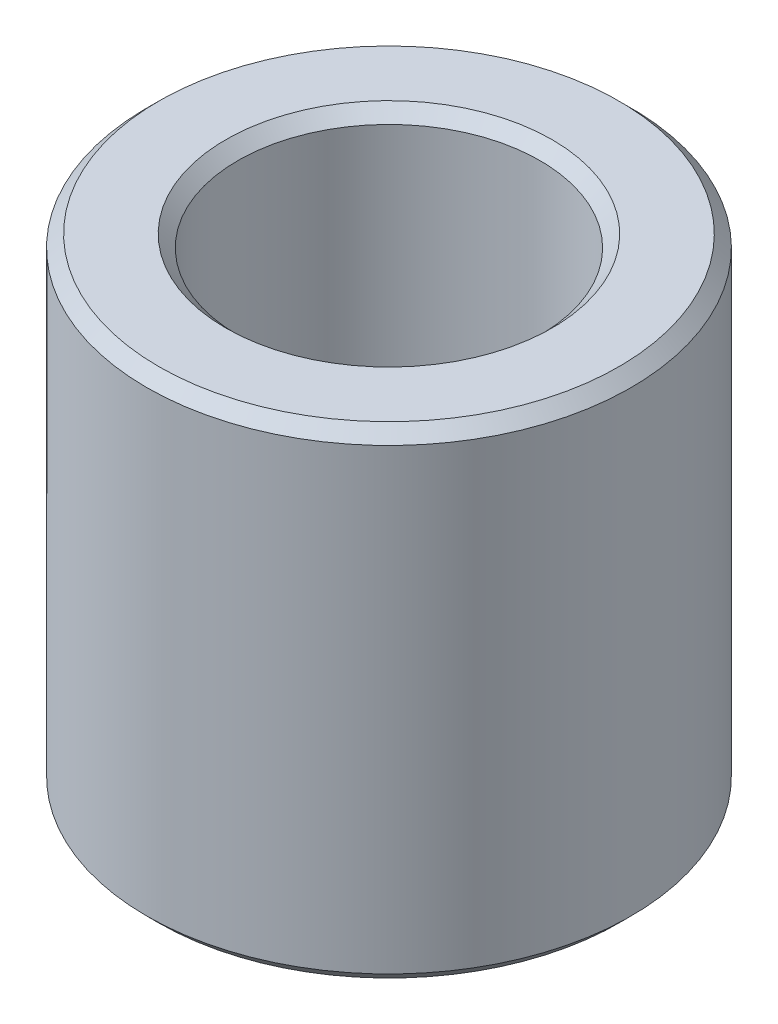
ISO-10303-21;
HEADER;
FILE_DESCRIPTION(('STEP AP214'),'2;1');
FILE_NAME('part.step','',(''),(''),'','','');
FILE_SCHEMA(('AUTOMOTIVE_DESIGN { 1 0 10303 214 1 1 1 1 }'));
ENDSEC;
DATA;
#1=APPLICATION_CONTEXT('core data for automotive mechanical design processes');
#2=APPLICATION_PROTOCOL_DEFINITION('international standard','automotive_design',2000,#1);
#3=PRODUCT_CONTEXT('',#1,'mechanical');
#4=PRODUCT('Part','Part','',(#3));
#5=PRODUCT_RELATED_PRODUCT_CATEGORY('part','',(#4));
#6=PRODUCT_DEFINITION_FORMATION('','',#4);
#7=PRODUCT_DEFINITION_CONTEXT('part definition',#1,'design');
#8=PRODUCT_DEFINITION('design','',#6,#7);
#9=PRODUCT_DEFINITION_SHAPE('','',#8);
#10=(LENGTH_UNIT() NAMED_UNIT(*) SI_UNIT(.MILLI.,.METRE.));
#11=(NAMED_UNIT(*) PLANE_ANGLE_UNIT() SI_UNIT($,.RADIAN.));
#12=(NAMED_UNIT(*) SI_UNIT($,.STERADIAN.) SOLID_ANGLE_UNIT());
#13=UNCERTAINTY_MEASURE_WITH_UNIT(LENGTH_MEASURE(1.E-05),#10,'distance_accuracy_value','');
#14=(GEOMETRIC_REPRESENTATION_CONTEXT(3) GLOBAL_UNCERTAINTY_ASSIGNED_CONTEXT((#13)) GLOBAL_UNIT_ASSIGNED_CONTEXT((#10,
#11,#12)) REPRESENTATION_CONTEXT('',''));
#15=CARTESIAN_POINT('',(0.,0.,0.));
#16=DIRECTION('',(0.,0.,1.));
#17=DIRECTION('',(1.,0.,0.));
#18=AXIS2_PLACEMENT_3D('',#15,#16,#17);
#19=CARTESIAN_POINT('',(0.,114.416073104183,0.));
#20=DIRECTION('',(0.,-1.,0.));
#21=DIRECTION('',(0.,0.,-1.));
#22=AXIS2_PLACEMENT_3D('',#19,#20,#21);
#23=CYLINDRICAL_SURFACE('',#22,57.5);
#24=CARTESIAN_POINT('',(0.,2.86756505842757,0.));
#25=DIRECTION('',(0.,1.,0.));
#26=DIRECTION('',(0.,0.,1.));
#27=AXIS2_PLACEMENT_3D('',#24,#25,#26);
#28=CIRCLE('',#27,57.5);
#29=CARTESIAN_POINT('',(0.,2.86756505842757,57.5));
#30=VERTEX_POINT('',#29);
#31=EDGE_CURVE('E10',#30,#30,#28,.T.);
#32=ORIENTED_EDGE('',*,*,#31,.T.);
#33=EDGE_LOOP('',(#32));
#34=FACE_BOUND('',#33,.T.);
#35=CARTESIAN_POINT('',(0.,111.548508045755,0.));
#36=DIRECTION('',(0.,1.,0.));
#37=DIRECTION('',(0.,0.,1.));
#38=AXIS2_PLACEMENT_3D('',#35,#36,#37);
#39=CIRCLE('',#38,57.5);
#40=CARTESIAN_POINT('',(0.,111.548508045755,57.5));
#41=VERTEX_POINT('',#40);
#42=EDGE_CURVE('E50',#41,#41,#39,.F.);
#43=ORIENTED_EDGE('',*,*,#42,.T.);
#44=EDGE_LOOP('',(#43));
#45=FACE_BOUND('',#44,.T.);
#46=ADVANCED_FACE('F39',(#34,#45),#23,.T.);
#47=CARTESIAN_POINT('',(0.,114.416073104183,0.));
#48=DIRECTION('',(0.,1.,0.));
#49=DIRECTION('',(0.,0.,1.));
#50=AXIS2_PLACEMENT_3D('',#47,#48,#49);
#51=PLANE('',#50);
#52=CARTESIAN_POINT('',(0.,114.416073104183,0.));
#53=DIRECTION('',(0.,1.,0.));
#54=DIRECTION('',(0.,0.,1.));
#55=AXIS2_PLACEMENT_3D('',#52,#53,#54);
#56=CIRCLE('',#55,38.7487187743204);
#57=CARTESIAN_POINT('',(0.,114.416073104183,38.7487187743204));
#58=VERTEX_POINT('',#57);
#59=EDGE_CURVE('E58',#58,#58,#56,.F.);
#60=ORIENTED_EDGE('',*,*,#59,.T.);
#61=EDGE_LOOP('',(#60));
#62=FACE_BOUND('',#61,.T.);
#63=CARTESIAN_POINT('',(0.,114.416073104183,0.));
#64=DIRECTION('',(0.,1.,0.));
#65=DIRECTION('',(0.,0.,1.));
#66=AXIS2_PLACEMENT_3D('',#63,#64,#65);
#67=CIRCLE('',#66,54.6324349415724);
#68=CARTESIAN_POINT('',(0.,114.416073104183,54.6324349415724));
#69=VERTEX_POINT('',#68);
#70=EDGE_CURVE('E61',#69,#69,#67,.T.);
#71=ORIENTED_EDGE('',*,*,#70,.T.);
#72=EDGE_LOOP('',(#71));
#73=FACE_BOUND('',#72,.T.);
#74=ADVANCED_FACE('F88',(#62,#73),#51,.T.);
#75=CARTESIAN_POINT('',(0.,0.,0.));
#76=DIRECTION('',(0.,1.,0.));
#77=DIRECTION('',(0.,0.,1.));
#78=AXIS2_PLACEMENT_3D('',#75,#76,#77);
#79=PLANE('',#78);
#80=CARTESIAN_POINT('',(0.,0.,0.));
#81=DIRECTION('',(0.,1.,0.));
#82=DIRECTION('',(0.,0.,1.));
#83=AXIS2_PLACEMENT_3D('',#80,#81,#82);
#84=CIRCLE('',#83,38.7487187743205);
#85=CARTESIAN_POINT('',(0.,0.,38.7487187743205));
#86=VERTEX_POINT('',#85);
#87=EDGE_CURVE('E51',#86,#86,#84,.T.);
#88=ORIENTED_EDGE('',*,*,#87,.T.);
#89=EDGE_LOOP('',(#88));
#90=FACE_BOUND('',#89,.T.);
#91=CARTESIAN_POINT('',(0.,0.,0.));
#92=DIRECTION('',(0.,1.,0.));
#93=DIRECTION('',(0.,0.,1.));
#94=AXIS2_PLACEMENT_3D('',#91,#92,#93);
#95=CIRCLE('',#94,54.6324349415724);
#96=CARTESIAN_POINT('',(0.,0.,54.6324349415724));
#97=VERTEX_POINT('',#96);
#98=EDGE_CURVE('E54',#97,#97,#95,.F.);
#99=ORIENTED_EDGE('',*,*,#98,.T.);
#100=EDGE_LOOP('',(#99));
#101=FACE_BOUND('',#100,.T.);
#102=ADVANCED_FACE('F83',(#90,#101),#79,.F.);
#103=CARTESIAN_POINT('',(0.,114.416073104183,0.));
#104=DIRECTION('',(0.,-1.,0.));
#105=DIRECTION('',(0.,0.,-1.));
#106=AXIS2_PLACEMENT_3D('',#103,#104,#105);
#107=CYLINDRICAL_SURFACE('',#106,35.8811537158928);
#108=CARTESIAN_POINT('',(0.,111.548508045755,0.));
#109=DIRECTION('',(0.,1.,0.));
#110=DIRECTION('',(0.,0.,1.));
#111=AXIS2_PLACEMENT_3D('',#108,#109,#110);
#112=CIRCLE('',#111,35.8811537158928);
#113=CARTESIAN_POINT('',(0.,111.548508045755,35.8811537158928));
#114=VERTEX_POINT('',#113);
#115=EDGE_CURVE('E67',#114,#114,#112,.T.);
#116=ORIENTED_EDGE('',*,*,#115,.T.);
#117=EDGE_LOOP('',(#116));
#118=FACE_BOUND('',#117,.T.);
#119=CARTESIAN_POINT('',(0.,2.86756505842763,0.));
#120=DIRECTION('',(0.,1.,0.));
#121=DIRECTION('',(0.,0.,1.));
#122=AXIS2_PLACEMENT_3D('',#119,#120,#121);
#123=CIRCLE('',#122,35.8811537158928);
#124=CARTESIAN_POINT('',(0.,2.86756505842763,35.8811537158928));
#125=VERTEX_POINT('',#124);
#126=EDGE_CURVE('E69',#125,#125,#123,.F.);
#127=ORIENTED_EDGE('',*,*,#126,.T.);
#128=EDGE_LOOP('',(#127));
#129=FACE_BOUND('',#128,.T.);
#130=ADVANCED_FACE('F71',(#118,#129),#107,.F.);
#131=CARTESIAN_POINT('',(0.,111.548508045755,0.));
#132=DIRECTION('',(0.,1.,0.));
#133=DIRECTION('',(0.,0.,1.));
#134=AXIS2_PLACEMENT_3D('',#131,#132,#133);
#135=CONICAL_SURFACE('',#134,35.8811537158928,0.78539816339745);
#136=ORIENTED_EDGE('',*,*,#59,.F.);
#137=EDGE_LOOP('',(#136));
#138=FACE_BOUND('',#137,.T.);
#139=ORIENTED_EDGE('',*,*,#115,.F.);
#140=EDGE_LOOP('',(#139));
#141=FACE_BOUND('',#140,.T.);
#142=ADVANCED_FACE('F77',(#138,#141),#135,.F.);
#143=CARTESIAN_POINT('',(0.,0.,0.));
#144=DIRECTION('',(0.,-1.,0.));
#145=DIRECTION('',(0.,0.,-1.));
#146=AXIS2_PLACEMENT_3D('',#143,#144,#145);
#147=CONICAL_SURFACE('',#146,38.7487187743205,0.785398163397447);
#148=ORIENTED_EDGE('',*,*,#126,.F.);
#149=EDGE_LOOP('',(#148));
#150=FACE_BOUND('',#149,.T.);
#151=ORIENTED_EDGE('',*,*,#87,.F.);
#152=EDGE_LOOP('',(#151));
#153=FACE_BOUND('',#152,.T.);
#154=ADVANCED_FACE('F73',(#150,#153),#147,.F.);
#155=CARTESIAN_POINT('',(0.,2.86756505842757,0.));
#156=DIRECTION('',(0.,1.,0.));
#157=DIRECTION('',(0.,0.,1.));
#158=AXIS2_PLACEMENT_3D('',#155,#156,#157);
#159=CONICAL_SURFACE('',#158,57.5,0.785398163397451);
#160=ORIENTED_EDGE('',*,*,#98,.F.);
#161=EDGE_LOOP('',(#160));
#162=FACE_BOUND('',#161,.T.);
#163=ORIENTED_EDGE('',*,*,#31,.F.);
#164=EDGE_LOOP('',(#163));
#165=FACE_BOUND('',#164,.T.);
#166=ADVANCED_FACE('F76',(#162,#165),#159,.T.);
#167=CARTESIAN_POINT('',(0.,114.416073104183,0.));
#168=DIRECTION('',(0.,-1.,0.));
#169=DIRECTION('',(0.,0.,-1.));
#170=AXIS2_PLACEMENT_3D('',#167,#168,#169);
#171=CONICAL_SURFACE('',#170,54.6324349415724,0.785398163397448);
#172=ORIENTED_EDGE('',*,*,#42,.F.);
#173=EDGE_LOOP('',(#172));
#174=FACE_BOUND('',#173,.T.);
#175=ORIENTED_EDGE('',*,*,#70,.F.);
#176=EDGE_LOOP('',(#175));
#177=FACE_BOUND('',#176,.T.);
#178=ADVANCED_FACE('F45',(#174,#177),#171,.T.);
#179=CLOSED_SHELL('',(#46,#74,#102,#130,#142,#154,#166,#178));
#180=MANIFOLD_SOLID_BREP('B2',#179);
#181=ADVANCED_BREP_SHAPE_REPRESENTATION('',(#18,#180),#14);
#182=SHAPE_DEFINITION_REPRESENTATION(#9,#181);
ENDSEC;
END-ISO-10303-21;
